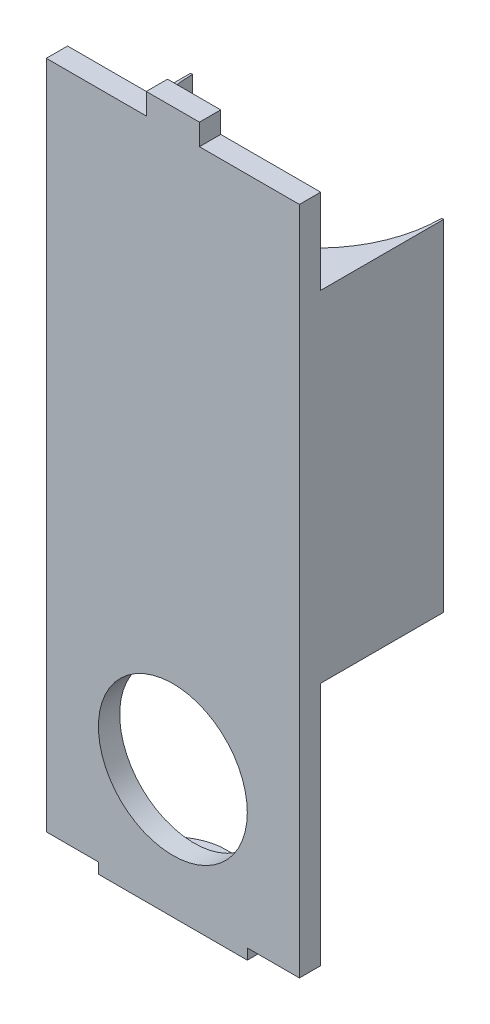
ISO-10303-21;
HEADER;
FILE_DESCRIPTION(('STEP AP214'),'2;1');
FILE_NAME('part.step','',(''),(''),'','','');
FILE_SCHEMA(('AUTOMOTIVE_DESIGN { 1 0 10303 214 1 1 1 1 }'));
ENDSEC;
DATA;
#1=APPLICATION_CONTEXT('core data for automotive mechanical design processes');
#2=APPLICATION_PROTOCOL_DEFINITION('international standard','automotive_design',2000,#1);
#3=PRODUCT_CONTEXT('',#1,'mechanical');
#4=PRODUCT('Part','Part','',(#3));
#5=PRODUCT_RELATED_PRODUCT_CATEGORY('part','',(#4));
#6=PRODUCT_DEFINITION_FORMATION('','',#4);
#7=PRODUCT_DEFINITION_CONTEXT('part definition',#1,'design');
#8=PRODUCT_DEFINITION('design','',#6,#7);
#9=PRODUCT_DEFINITION_SHAPE('','',#8);
#10=(LENGTH_UNIT() NAMED_UNIT(*) SI_UNIT(.MILLI.,.METRE.));
#11=(NAMED_UNIT(*) PLANE_ANGLE_UNIT() SI_UNIT($,.RADIAN.));
#12=(NAMED_UNIT(*) SI_UNIT($,.STERADIAN.) SOLID_ANGLE_UNIT());
#13=UNCERTAINTY_MEASURE_WITH_UNIT(LENGTH_MEASURE(1.E-05),#10,'distance_accuracy_value','');
#14=(GEOMETRIC_REPRESENTATION_CONTEXT(3) GLOBAL_UNCERTAINTY_ASSIGNED_CONTEXT((#13)) GLOBAL_UNIT_ASSIGNED_CONTEXT((#10,
#11,#12)) REPRESENTATION_CONTEXT('',''));
#15=CARTESIAN_POINT('',(0.,0.,0.));
#16=DIRECTION('',(0.,0.,1.));
#17=DIRECTION('',(1.,0.,0.));
#18=AXIS2_PLACEMENT_3D('',#15,#16,#17);
#19=CARTESIAN_POINT('',(0.,-23.,0.));
#20=DIRECTION('',(0.,1.,0.));
#21=DIRECTION('',(0.,0.,1.));
#22=AXIS2_PLACEMENT_3D('',#19,#20,#21);
#23=PLANE('',#22);
#24=DIRECTION('',(0.,0.,1.));
#25=VECTOR('',#24,1.);
#26=CARTESIAN_POINT('',(7.,-23.,0.));
#27=LINE('',#26,#25);
#28=CARTESIAN_POINT('',(7.,-23.,12.));
#29=VERTEX_POINT('',#28);
#30=CARTESIAN_POINT('',(7.,-23.,14.));
#31=VERTEX_POINT('',#30);
#32=EDGE_CURVE('E202',#29,#31,#27,.T.);
#33=ORIENTED_EDGE('',*,*,#32,.F.);
#34=DIRECTION('',(1.,0.,0.));
#35=VECTOR('',#34,1.);
#36=CARTESIAN_POINT('',(-11.9,-23.,12.));
#37=LINE('',#36,#35);
#38=CARTESIAN_POINT('',(11.9,-23.,12.));
#39=VERTEX_POINT('',#38);
#40=EDGE_CURVE('E219',#29,#39,#37,.T.);
#41=ORIENTED_EDGE('',*,*,#40,.T.);
#42=DIRECTION('',(0.,0.,-1.));
#43=VECTOR('',#42,1.);
#44=CARTESIAN_POINT('',(11.9,-23.,14.));
#45=LINE('',#44,#43);
#46=CARTESIAN_POINT('',(11.9,-23.,14.));
#47=VERTEX_POINT('',#46);
#48=EDGE_CURVE('E237',#47,#39,#45,.T.);
#49=ORIENTED_EDGE('',*,*,#48,.F.);
#50=DIRECTION('',(1.,0.,0.));
#51=VECTOR('',#50,1.);
#52=CARTESIAN_POINT('',(-11.9,-23.,14.));
#53=LINE('',#52,#51);
#54=EDGE_CURVE('E221',#31,#47,#53,.T.);
#55=ORIENTED_EDGE('',*,*,#54,.F.);
#56=EDGE_LOOP('',(#33,#41,#49,#55));
#57=FACE_BOUND('',#56,.T.);
#58=ADVANCED_FACE('F41',(#57),#23,.F.);
#59=CARTESIAN_POINT('',(0.,40.,0.));
#60=DIRECTION('',(0.,-1.,0.));
#61=DIRECTION('',(0.,0.,-1.));
#62=AXIS2_PLACEMENT_3D('',#59,#60,#61);
#63=PLANE('',#62);
#64=DIRECTION('',(0.,0.,-1.));
#65=VECTOR('',#64,1.);
#66=CARTESIAN_POINT('',(2.5,40.,0.));
#67=LINE('',#66,#65);
#68=CARTESIAN_POINT('',(2.5,40.,14.));
#69=VERTEX_POINT('',#68);
#70=CARTESIAN_POINT('',(2.5,40.,12.));
#71=VERTEX_POINT('',#70);
#72=EDGE_CURVE('E396',#69,#71,#67,.T.);
#73=ORIENTED_EDGE('',*,*,#72,.F.);
#74=DIRECTION('',(1.,0.,0.));
#75=VECTOR('',#74,1.);
#76=CARTESIAN_POINT('',(-11.9,40.,14.));
#77=LINE('',#76,#75);
#78=CARTESIAN_POINT('',(11.9,40.,14.));
#79=VERTEX_POINT('',#78);
#80=EDGE_CURVE('E371',#69,#79,#77,.T.);
#81=ORIENTED_EDGE('',*,*,#80,.T.);
#82=DIRECTION('',(0.,0.,-1.));
#83=VECTOR('',#82,1.);
#84=CARTESIAN_POINT('',(11.9,40.,14.));
#85=LINE('',#84,#83);
#86=CARTESIAN_POINT('',(11.9,40.,12.));
#87=VERTEX_POINT('',#86);
#88=EDGE_CURVE('E358',#79,#87,#85,.T.);
#89=ORIENTED_EDGE('',*,*,#88,.T.);
#90=DIRECTION('',(-1.,0.,0.));
#91=VECTOR('',#90,1.);
#92=CARTESIAN_POINT('',(-11.9,40.,12.));
#93=LINE('',#92,#91);
#94=EDGE_CURVE('E369',#87,#71,#93,.T.);
#95=ORIENTED_EDGE('',*,*,#94,.T.);
#96=EDGE_LOOP('',(#73,#81,#89,#95));
#97=FACE_BOUND('',#96,.T.);
#98=ADVANCED_FACE('F395',(#97),#63,.F.);
#99=CARTESIAN_POINT('',(0.,0.,0.));
#100=DIRECTION('',(0.,1.,0.));
#101=DIRECTION('',(0.,0.,1.));
#102=AXIS2_PLACEMENT_3D('',#99,#100,#101);
#103=PLANE('',#102);
#104=DIRECTION('',(1.,0.,0.));
#105=VECTOR('',#104,1.);
#106=CARTESIAN_POINT('',(-11.9,0.,12.));
#107=LINE('',#106,#105);
#108=CARTESIAN_POINT('',(-11.9,0.,12.));
#109=VERTEX_POINT('',#108);
#110=CARTESIAN_POINT('',(11.9,0.,12.));
#111=VERTEX_POINT('',#110);
#112=EDGE_CURVE('E233',#109,#111,#107,.T.);
#113=ORIENTED_EDGE('',*,*,#112,.F.);
#114=DIRECTION('',(0.,0.,1.));
#115=VECTOR('',#114,1.);
#116=CARTESIAN_POINT('',(-11.9,0.,0.431741638678327));
#117=LINE('',#116,#115);
#118=CARTESIAN_POINT('',(-11.9,0.,0.431741638678322));
#119=VERTEX_POINT('',#118);
#120=EDGE_CURVE('E275',#119,#109,#117,.T.);
#121=ORIENTED_EDGE('',*,*,#120,.F.);
#122=DIRECTION('',(1.,0.,0.));
#123=VECTOR('',#122,1.);
#124=CARTESIAN_POINT('',(0.,0.,0.43174163867832));
#125=LINE('',#124,#123);
#126=CARTESIAN_POINT('',(-11.7210822087198,0.,0.431741638678322));
#127=VERTEX_POINT('',#126);
#128=EDGE_CURVE('E307',#119,#127,#125,.T.);
#129=ORIENTED_EDGE('',*,*,#128,.T.);
#130=CARTESIAN_POINT('',(0.,0.,0.431741638678323));
#131=DIRECTION('',(0.,1.,0.));
#132=DIRECTION('',(0.,0.,1.));
#133=AXIS2_PLACEMENT_3D('',#130,#131,#132);
#134=CIRCLE('',#133,11.7210822087198);
#135=CARTESIAN_POINT('',(-8.48935923549125,0.,8.51348327735666));
#136=VERTEX_POINT('',#135);
#137=EDGE_CURVE('E303',#127,#136,#134,.T.);
#138=ORIENTED_EDGE('',*,*,#137,.T.);
#139=DIRECTION('',(1.,0.,0.));
#140=VECTOR('',#139,1.);
#141=CARTESIAN_POINT('',(0.,0.,8.51348327735666));
#142=LINE('',#141,#140);
#143=CARTESIAN_POINT('',(8.48935923549126,0.,8.51348327735665));
#144=VERTEX_POINT('',#143);
#145=EDGE_CURVE('E285',#136,#144,#142,.T.);
#146=ORIENTED_EDGE('',*,*,#145,.T.);
#147=CARTESIAN_POINT('',(11.7210822087198,0.,0.431741638678318));
#148=VERTEX_POINT('',#147);
#149=EDGE_CURVE('E291',#144,#148,#134,.T.);
#150=ORIENTED_EDGE('',*,*,#149,.T.);
#151=CARTESIAN_POINT('',(11.9,0.,0.431741638678318));
#152=VERTEX_POINT('',#151);
#153=EDGE_CURVE('E310',#148,#152,#125,.T.);
#154=ORIENTED_EDGE('',*,*,#153,.T.);
#155=DIRECTION('',(0.,0.,1.));
#156=VECTOR('',#155,1.);
#157=CARTESIAN_POINT('',(11.9,0.,0.431741638678327));
#158=LINE('',#157,#156);
#159=EDGE_CURVE('E269',#152,#111,#158,.T.);
#160=ORIENTED_EDGE('',*,*,#159,.T.);
#161=EDGE_LOOP('',(#113,#121,#129,#138,#146,#150,#154,#160));
#162=FACE_BOUND('',#161,.T.);
#163=ADVANCED_FACE('F507',(#162),#103,.F.);
#164=CARTESIAN_POINT('',(0.,32.,14.));
#165=DIRECTION('',(0.,0.,-1.));
#166=DIRECTION('',(-1.,0.,0.));
#167=AXIS2_PLACEMENT_3D('',#164,#165,#166);
#168=PLANE('',#167);
#169=CARTESIAN_POINT('',(0.,-11.9700847404903,14.));
#170=DIRECTION('',(0.,0.,1.));
#171=DIRECTION('',(1.,0.,0.));
#172=AXIS2_PLACEMENT_3D('',#169,#170,#171);
#173=CIRCLE('',#172,7.);
#174=CARTESIAN_POINT('',(7.,-11.9700847404903,14.));
#175=VERTEX_POINT('',#174);
#176=EDGE_CURVE('E428',#175,#175,#173,.T.);
#177=ORIENTED_EDGE('',*,*,#176,.F.);
#178=EDGE_LOOP('',(#177));
#179=FACE_BOUND('',#178,.T.);
#180=DIRECTION('',(0.,1.,0.));
#181=VECTOR('',#180,1.);
#182=CARTESIAN_POINT('',(11.9,32.,14.));
#183=LINE('',#182,#181);
#184=EDGE_CURVE('E265',#47,#79,#183,.T.);
#185=ORIENTED_EDGE('',*,*,#184,.T.);
#186=ORIENTED_EDGE('',*,*,#80,.F.);
#187=DIRECTION('',(0.,-1.,0.));
#188=VECTOR('',#187,1.);
#189=CARTESIAN_POINT('',(2.5,42.,14.));
#190=LINE('',#189,#188);
#191=CARTESIAN_POINT('',(2.5,42.,14.));
#192=VERTEX_POINT('',#191);
#193=EDGE_CURVE('E402',#192,#69,#190,.T.);
#194=ORIENTED_EDGE('',*,*,#193,.F.);
#195=DIRECTION('',(1.,0.,0.));
#196=VECTOR('',#195,1.);
#197=CARTESIAN_POINT('',(0.,42.,14.));
#198=LINE('',#197,#196);
#199=CARTESIAN_POINT('',(-2.5,42.,14.));
#200=VERTEX_POINT('',#199);
#201=EDGE_CURVE('E410',#200,#192,#198,.T.);
#202=ORIENTED_EDGE('',*,*,#201,.F.);
#203=DIRECTION('',(0.,-1.,0.));
#204=VECTOR('',#203,1.);
#205=CARTESIAN_POINT('',(-2.5,42.,14.));
#206=LINE('',#205,#204);
#207=CARTESIAN_POINT('',(-2.5,40.,14.));
#208=VERTEX_POINT('',#207);
#209=EDGE_CURVE('E424',#200,#208,#206,.T.);
#210=ORIENTED_EDGE('',*,*,#209,.T.);
#211=CARTESIAN_POINT('',(-11.9,40.,14.));
#212=VERTEX_POINT('',#211);
#213=EDGE_CURVE('E365',#212,#208,#77,.T.);
#214=ORIENTED_EDGE('',*,*,#213,.F.);
#215=DIRECTION('',(0.,1.,0.));
#216=VECTOR('',#215,1.);
#217=CARTESIAN_POINT('',(-11.9,32.,14.));
#218=LINE('',#217,#216);
#219=CARTESIAN_POINT('',(-11.9,-23.,14.));
#220=VERTEX_POINT('',#219);
#221=EDGE_CURVE('E279',#220,#212,#218,.T.);
#222=ORIENTED_EDGE('',*,*,#221,.F.);
#223=CARTESIAN_POINT('',(-7.,-23.,14.));
#224=VERTEX_POINT('',#223);
#225=EDGE_CURVE('E245',#220,#224,#53,.T.);
#226=ORIENTED_EDGE('',*,*,#225,.T.);
#227=DIRECTION('',(0.,1.,0.));
#228=VECTOR('',#227,1.);
#229=CARTESIAN_POINT('',(-7.,-24.,14.));
#230=LINE('',#229,#228);
#231=CARTESIAN_POINT('',(-7.,-24.,14.));
#232=VERTEX_POINT('',#231);
#233=EDGE_CURVE('E450',#232,#224,#230,.T.);
#234=ORIENTED_EDGE('',*,*,#233,.F.);
#235=DIRECTION('',(-1.,0.,0.));
#236=VECTOR('',#235,1.);
#237=CARTESIAN_POINT('',(0.,-24.,14.));
#238=LINE('',#237,#236);
#239=CARTESIAN_POINT('',(7.,-24.,14.));
#240=VERTEX_POINT('',#239);
#241=EDGE_CURVE('E459',#240,#232,#238,.T.);
#242=ORIENTED_EDGE('',*,*,#241,.F.);
#243=DIRECTION('',(0.,1.,0.));
#244=VECTOR('',#243,1.);
#245=CARTESIAN_POINT('',(7.,-24.,14.));
#246=LINE('',#245,#244);
#247=EDGE_CURVE('E353',#240,#31,#246,.T.);
#248=ORIENTED_EDGE('',*,*,#247,.T.);
#249=ORIENTED_EDGE('',*,*,#54,.T.);
#250=EDGE_LOOP('',(#185,#186,#194,#202,#210,#214,#222,#226,#234,#242,#248,#249));
#251=FACE_BOUND('',#250,.T.);
#252=ADVANCED_FACE('F349',(#179,#251),#168,.F.);
#253=CARTESIAN_POINT('',(0.,32.,0.));
#254=DIRECTION('',(0.,1.,0.));
#255=DIRECTION('',(0.,0.,1.));
#256=AXIS2_PLACEMENT_3D('',#253,#254,#255);
#257=PLANE('',#256);
#258=DIRECTION('',(-1.,0.,0.));
#259=VECTOR('',#258,1.);
#260=CARTESIAN_POINT('',(-11.9,32.,12.));
#261=LINE('',#260,#259);
#262=CARTESIAN_POINT('',(11.9,32.,12.));
#263=VERTEX_POINT('',#262);
#264=CARTESIAN_POINT('',(-11.9,32.,12.));
#265=VERTEX_POINT('',#264);
#266=EDGE_CURVE('E377',#263,#265,#261,.T.);
#267=ORIENTED_EDGE('',*,*,#266,.F.);
#268=DIRECTION('',(0.,0.,-1.));
#269=VECTOR('',#268,1.);
#270=CARTESIAN_POINT('',(11.9,32.,0.431741638678323));
#271=LINE('',#270,#269);
#272=CARTESIAN_POINT('',(11.9,32.,0.431741638678323));
#273=VERTEX_POINT('',#272);
#274=EDGE_CURVE('E262',#263,#273,#271,.T.);
#275=ORIENTED_EDGE('',*,*,#274,.T.);
#276=DIRECTION('',(1.,0.,0.));
#277=VECTOR('',#276,1.);
#278=CARTESIAN_POINT('',(0.,32.,0.43174163867832));
#279=LINE('',#278,#277);
#280=CARTESIAN_POINT('',(11.7210822087198,32.,0.431741638678318));
#281=VERTEX_POINT('',#280);
#282=EDGE_CURVE('E299',#281,#273,#279,.T.);
#283=ORIENTED_EDGE('',*,*,#282,.F.);
#284=CARTESIAN_POINT('',(0.,32.,0.431741638678323));
#285=DIRECTION('',(0.,1.,0.));
#286=DIRECTION('',(0.,0.,1.));
#287=AXIS2_PLACEMENT_3D('',#284,#285,#286);
#288=CIRCLE('',#287,11.7210822087198);
#289=CARTESIAN_POINT('',(8.48935923549126,32.,8.51348327735665));
#290=VERTEX_POINT('',#289);
#291=EDGE_CURVE('E296',#290,#281,#288,.T.);
#292=ORIENTED_EDGE('',*,*,#291,.F.);
#293=DIRECTION('',(1.,0.,0.));
#294=VECTOR('',#293,1.);
#295=CARTESIAN_POINT('',(0.,32.,8.51348327735666));
#296=LINE('',#295,#294);
#297=CARTESIAN_POINT('',(-8.48935923549125,32.,8.51348327735666));
#298=VERTEX_POINT('',#297);
#299=EDGE_CURVE('E286',#298,#290,#296,.T.);
#300=ORIENTED_EDGE('',*,*,#299,.F.);
#301=CARTESIAN_POINT('',(-11.7210822087198,32.,0.431741638678322));
#302=VERTEX_POINT('',#301);
#303=EDGE_CURVE('E290',#302,#298,#288,.T.);
#304=ORIENTED_EDGE('',*,*,#303,.F.);
#305=CARTESIAN_POINT('',(-11.9,32.,0.431741638678323));
#306=VERTEX_POINT('',#305);
#307=EDGE_CURVE('E295',#306,#302,#279,.T.);
#308=ORIENTED_EDGE('',*,*,#307,.F.);
#309=DIRECTION('',(0.,0.,-1.));
#310=VECTOR('',#309,1.);
#311=CARTESIAN_POINT('',(-11.9,32.,0.431741638678323));
#312=LINE('',#311,#310);
#313=EDGE_CURVE('E282',#265,#306,#312,.T.);
#314=ORIENTED_EDGE('',*,*,#313,.F.);
#315=EDGE_LOOP('',(#267,#275,#283,#292,#300,#304,#308,#314));
#316=FACE_BOUND('',#315,.T.);
#317=ADVANCED_FACE('F546',(#316),#257,.T.);
#318=CARTESIAN_POINT('',(0.,32.,0.43174163867832));
#319=DIRECTION('',(0.,0.,-1.));
#320=DIRECTION('',(-1.,0.,0.));
#321=AXIS2_PLACEMENT_3D('',#318,#319,#320);
#322=PLANE('',#321);
#323=ORIENTED_EDGE('',*,*,#282,.T.);
#324=DIRECTION('',(0.,-1.,0.));
#325=VECTOR('',#324,1.);
#326=CARTESIAN_POINT('',(11.9,32.,0.431741638678323));
#327=LINE('',#326,#325);
#328=EDGE_CURVE('E258',#273,#152,#327,.T.);
#329=ORIENTED_EDGE('',*,*,#328,.T.);
#330=ORIENTED_EDGE('',*,*,#153,.F.);
#331=DIRECTION('',(0.,-1.,0.));
#332=VECTOR('',#331,1.);
#333=CARTESIAN_POINT('',(11.7210822087198,32.,0.431741638678318));
#334=LINE('',#333,#332);
#335=EDGE_CURVE('E314',#281,#148,#334,.T.);
#336=ORIENTED_EDGE('',*,*,#335,.F.);
#337=EDGE_LOOP('',(#323,#329,#330,#336));
#338=FACE_BOUND('',#337,.T.);
#339=ADVANCED_FACE('F544',(#338),#322,.T.);
#340=ORIENTED_EDGE('',*,*,#128,.F.);
#341=DIRECTION('',(0.,-1.,0.));
#342=VECTOR('',#341,1.);
#343=CARTESIAN_POINT('',(-11.9,32.,0.431741638678323));
#344=LINE('',#343,#342);
#345=EDGE_CURVE('E272',#306,#119,#344,.T.);
#346=ORIENTED_EDGE('',*,*,#345,.F.);
#347=ORIENTED_EDGE('',*,*,#307,.T.);
#348=DIRECTION('',(0.,-1.,0.));
#349=VECTOR('',#348,1.);
#350=CARTESIAN_POINT('',(-11.7210822087198,32.,0.431741638678322));
#351=LINE('',#350,#349);
#352=EDGE_CURVE('E317',#302,#127,#351,.T.);
#353=ORIENTED_EDGE('',*,*,#352,.T.);
#354=EDGE_LOOP('',(#340,#346,#347,#353));
#355=FACE_BOUND('',#354,.T.);
#356=ADVANCED_FACE('F528',(#355),#322,.T.);
#357=CARTESIAN_POINT('',(0.,32.,8.51348327735666));
#358=DIRECTION('',(0.,0.,-1.));
#359=DIRECTION('',(-1.,0.,0.));
#360=AXIS2_PLACEMENT_3D('',#357,#358,#359);
#361=PLANE('',#360);
#362=ORIENTED_EDGE('',*,*,#145,.F.);
#363=DIRECTION('',(0.,-1.,0.));
#364=VECTOR('',#363,1.);
#365=CARTESIAN_POINT('',(-8.48935923549125,32.,8.51348327735666));
#366=LINE('',#365,#364);
#367=EDGE_CURVE('E321',#298,#136,#366,.T.);
#368=ORIENTED_EDGE('',*,*,#367,.F.);
#369=ORIENTED_EDGE('',*,*,#299,.T.);
#370=DIRECTION('',(0.,-1.,0.));
#371=VECTOR('',#370,1.);
#372=CARTESIAN_POINT('',(8.48935923549126,32.,8.51348327735665));
#373=LINE('',#372,#371);
#374=EDGE_CURVE('E311',#290,#144,#373,.T.);
#375=ORIENTED_EDGE('',*,*,#374,.T.);
#376=EDGE_LOOP('',(#362,#368,#369,#375));
#377=FACE_BOUND('',#376,.T.);
#378=ADVANCED_FACE('F548',(#377),#361,.T.);
#379=CARTESIAN_POINT('',(0.,32.,0.431741638678323));
#380=DIRECTION('',(0.,-1.,0.));
#381=DIRECTION('',(0.,0.,-1.));
#382=AXIS2_PLACEMENT_3D('',#379,#380,#381);
#383=CYLINDRICAL_SURFACE('',#382,11.7210822087198);
#384=ORIENTED_EDGE('',*,*,#137,.F.);
#385=ORIENTED_EDGE('',*,*,#352,.F.);
#386=ORIENTED_EDGE('',*,*,#303,.T.);
#387=ORIENTED_EDGE('',*,*,#367,.T.);
#388=EDGE_LOOP('',(#384,#385,#386,#387));
#389=FACE_BOUND('',#388,.T.);
#390=ADVANCED_FACE('F534',(#389),#383,.F.);
#391=ORIENTED_EDGE('',*,*,#149,.F.);
#392=ORIENTED_EDGE('',*,*,#374,.F.);
#393=ORIENTED_EDGE('',*,*,#291,.T.);
#394=ORIENTED_EDGE('',*,*,#335,.T.);
#395=EDGE_LOOP('',(#391,#392,#393,#394));
#396=FACE_BOUND('',#395,.T.);
#397=ADVANCED_FACE('F539',(#396),#383,.F.);
#398=CARTESIAN_POINT('',(-11.9,0.,0.));
#399=DIRECTION('',(-1.,0.,0.));
#400=DIRECTION('',(0.,0.,1.));
#401=AXIS2_PLACEMENT_3D('',#398,#399,#400);
#402=PLANE('',#401);
#403=ORIENTED_EDGE('',*,*,#345,.T.);
#404=ORIENTED_EDGE('',*,*,#120,.T.);
#405=DIRECTION('',(0.,1.,0.));
#406=VECTOR('',#405,1.);
#407=CARTESIAN_POINT('',(-11.9,-23.,12.));
#408=LINE('',#407,#406);
#409=CARTESIAN_POINT('',(-11.9,-23.,12.));
#410=VERTEX_POINT('',#409);
#411=EDGE_CURVE('E251',#410,#109,#408,.T.);
#412=ORIENTED_EDGE('',*,*,#411,.F.);
#413=DIRECTION('',(0.,0.,-1.));
#414=VECTOR('',#413,1.);
#415=CARTESIAN_POINT('',(-11.9,-23.,14.));
#416=LINE('',#415,#414);
#417=EDGE_CURVE('E249',#220,#410,#416,.T.);
#418=ORIENTED_EDGE('',*,*,#417,.F.);
#419=ORIENTED_EDGE('',*,*,#221,.T.);
#420=DIRECTION('',(0.,0.,1.));
#421=VECTOR('',#420,1.);
#422=CARTESIAN_POINT('',(-11.9,40.,14.));
#423=LINE('',#422,#421);
#424=CARTESIAN_POINT('',(-11.9,40.,12.));
#425=VERTEX_POINT('',#424);
#426=EDGE_CURVE('E380',#425,#212,#423,.T.);
#427=ORIENTED_EDGE('',*,*,#426,.F.);
#428=DIRECTION('',(0.,-1.,0.));
#429=VECTOR('',#428,1.);
#430=CARTESIAN_POINT('',(-11.9,40.,12.));
#431=LINE('',#430,#429);
#432=EDGE_CURVE('E376',#425,#265,#431,.T.);
#433=ORIENTED_EDGE('',*,*,#432,.T.);
#434=ORIENTED_EDGE('',*,*,#313,.T.);
#435=EDGE_LOOP('',(#403,#404,#412,#418,#419,#427,#433,#434));
#436=FACE_BOUND('',#435,.T.);
#437=ADVANCED_FACE('F522',(#436),#402,.T.);
#438=CARTESIAN_POINT('',(11.9,0.,0.));
#439=DIRECTION('',(1.,0.,0.));
#440=DIRECTION('',(0.,0.,1.));
#441=AXIS2_PLACEMENT_3D('',#438,#439,#440);
#442=PLANE('',#441);
#443=ORIENTED_EDGE('',*,*,#328,.F.);
#444=ORIENTED_EDGE('',*,*,#274,.F.);
#445=DIRECTION('',(0.,-1.,0.));
#446=VECTOR('',#445,1.);
#447=CARTESIAN_POINT('',(11.9,40.,12.));
#448=LINE('',#447,#446);
#449=EDGE_CURVE('E238',#87,#263,#448,.T.);
#450=ORIENTED_EDGE('',*,*,#449,.F.);
#451=ORIENTED_EDGE('',*,*,#88,.F.);
#452=ORIENTED_EDGE('',*,*,#184,.F.);
#453=ORIENTED_EDGE('',*,*,#48,.T.);
#454=DIRECTION('',(0.,1.,0.));
#455=VECTOR('',#454,1.);
#456=CARTESIAN_POINT('',(11.9,-23.,12.));
#457=LINE('',#456,#455);
#458=EDGE_CURVE('E229',#39,#111,#457,.T.);
#459=ORIENTED_EDGE('',*,*,#458,.T.);
#460=ORIENTED_EDGE('',*,*,#159,.F.);
#461=EDGE_LOOP('',(#443,#444,#450,#451,#452,#453,#459,#460));
#462=FACE_BOUND('',#461,.T.);
#463=ADVANCED_FACE('F356',(#462),#442,.T.);
#464=CARTESIAN_POINT('',(-11.9,-23.,12.));
#465=DIRECTION('',(0.,0.,1.));
#466=DIRECTION('',(1.,0.,0.));
#467=AXIS2_PLACEMENT_3D('',#464,#465,#466);
#468=PLANE('',#467);
#469=CARTESIAN_POINT('',(0.,-11.9700847404903,12.));
#470=DIRECTION('',(0.,0.,1.));
#471=DIRECTION('',(1.,0.,0.));
#472=AXIS2_PLACEMENT_3D('',#469,#470,#471);
#473=CIRCLE('',#472,7.);
#474=CARTESIAN_POINT('',(7.,-11.9700847404903,12.));
#475=VERTEX_POINT('',#474);
#476=EDGE_CURVE('E381',#475,#475,#473,.F.);
#477=ORIENTED_EDGE('',*,*,#476,.F.);
#478=EDGE_LOOP('',(#477));
#479=FACE_BOUND('',#478,.T.);
#480=ORIENTED_EDGE('',*,*,#40,.F.);
#481=DIRECTION('',(-1.,0.,0.));
#482=VECTOR('',#481,1.);
#483=CARTESIAN_POINT('',(-7.,-23.,12.));
#484=LINE('',#483,#482);
#485=CARTESIAN_POINT('',(-7.,-23.,12.));
#486=VERTEX_POINT('',#485);
#487=EDGE_CURVE('E206',#29,#486,#484,.T.);
#488=ORIENTED_EDGE('',*,*,#487,.T.);
#489=EDGE_CURVE('E232',#410,#486,#37,.T.);
#490=ORIENTED_EDGE('',*,*,#489,.F.);
#491=ORIENTED_EDGE('',*,*,#411,.T.);
#492=ORIENTED_EDGE('',*,*,#112,.T.);
#493=ORIENTED_EDGE('',*,*,#458,.F.);
#494=EDGE_LOOP('',(#480,#488,#490,#491,#492,#493));
#495=FACE_BOUND('',#494,.T.);
#496=ADVANCED_FACE('F226',(#479,#495),#468,.F.);
#497=ORIENTED_EDGE('',*,*,#489,.T.);
#498=DIRECTION('',(0.,0.,1.));
#499=VECTOR('',#498,1.);
#500=CARTESIAN_POINT('',(-7.,-23.,0.));
#501=LINE('',#500,#499);
#502=EDGE_CURVE('E223',#486,#224,#501,.T.);
#503=ORIENTED_EDGE('',*,*,#502,.T.);
#504=ORIENTED_EDGE('',*,*,#225,.F.);
#505=ORIENTED_EDGE('',*,*,#417,.T.);
#506=EDGE_LOOP('',(#497,#503,#504,#505));
#507=FACE_BOUND('',#506,.T.);
#508=ADVANCED_FACE('F503',(#507),#23,.F.);
#509=CARTESIAN_POINT('',(-11.9,40.,12.));
#510=DIRECTION('',(0.,0.,1.));
#511=DIRECTION('',(1.,0.,0.));
#512=AXIS2_PLACEMENT_3D('',#509,#510,#511);
#513=PLANE('',#512);
#514=ORIENTED_EDGE('',*,*,#266,.T.);
#515=ORIENTED_EDGE('',*,*,#432,.F.);
#516=CARTESIAN_POINT('',(-2.5,40.,12.));
#517=VERTEX_POINT('',#516);
#518=EDGE_CURVE('E364',#517,#425,#93,.T.);
#519=ORIENTED_EDGE('',*,*,#518,.F.);
#520=DIRECTION('',(0.,-1.,0.));
#521=VECTOR('',#520,1.);
#522=CARTESIAN_POINT('',(-2.5,42.,12.));
#523=LINE('',#522,#521);
#524=CARTESIAN_POINT('',(-2.5,42.,12.));
#525=VERTEX_POINT('',#524);
#526=EDGE_CURVE('E415',#525,#517,#523,.T.);
#527=ORIENTED_EDGE('',*,*,#526,.F.);
#528=DIRECTION('',(-1.,0.,0.));
#529=VECTOR('',#528,1.);
#530=CARTESIAN_POINT('',(0.,42.,12.));
#531=LINE('',#530,#529);
#532=CARTESIAN_POINT('',(2.5,42.,12.));
#533=VERTEX_POINT('',#532);
#534=EDGE_CURVE('E419',#533,#525,#531,.T.);
#535=ORIENTED_EDGE('',*,*,#534,.F.);
#536=DIRECTION('',(0.,-1.,0.));
#537=VECTOR('',#536,1.);
#538=CARTESIAN_POINT('',(2.5,42.,12.));
#539=LINE('',#538,#537);
#540=EDGE_CURVE('E393',#533,#71,#539,.T.);
#541=ORIENTED_EDGE('',*,*,#540,.T.);
#542=ORIENTED_EDGE('',*,*,#94,.F.);
#543=ORIENTED_EDGE('',*,*,#449,.T.);
#544=EDGE_LOOP('',(#514,#515,#519,#527,#535,#541,#542,#543));
#545=FACE_BOUND('',#544,.T.);
#546=ADVANCED_FACE('F389',(#545),#513,.F.);
#547=ORIENTED_EDGE('',*,*,#213,.T.);
#548=DIRECTION('',(0.,0.,-1.));
#549=VECTOR('',#548,1.);
#550=CARTESIAN_POINT('',(-2.5,40.,0.));
#551=LINE('',#550,#549);
#552=EDGE_CURVE('E405',#208,#517,#551,.T.);
#553=ORIENTED_EDGE('',*,*,#552,.T.);
#554=ORIENTED_EDGE('',*,*,#518,.T.);
#555=ORIENTED_EDGE('',*,*,#426,.T.);
#556=EDGE_LOOP('',(#547,#553,#554,#555));
#557=FACE_BOUND('',#556,.T.);
#558=ADVANCED_FACE('F509',(#557),#63,.F.);
#559=CARTESIAN_POINT('',(0.,-11.9700847404903,0.430741638678319));
#560=DIRECTION('',(0.,0.,1.));
#561=DIRECTION('',(1.,0.,0.));
#562=AXIS2_PLACEMENT_3D('',#559,#560,#561);
#563=CYLINDRICAL_SURFACE('',#562,7.);
#564=ORIENTED_EDGE('',*,*,#176,.T.);
#565=EDGE_LOOP('',(#564));
#566=FACE_BOUND('',#565,.T.);
#567=ORIENTED_EDGE('',*,*,#476,.T.);
#568=EDGE_LOOP('',(#567));
#569=FACE_BOUND('',#568,.T.);
#570=ADVANCED_FACE('F680',(#566,#569),#563,.F.);
#571=CARTESIAN_POINT('',(-2.5,42.,0.));
#572=DIRECTION('',(-1.,0.,0.));
#573=DIRECTION('',(0.,0.,1.));
#574=AXIS2_PLACEMENT_3D('',#571,#572,#573);
#575=PLANE('',#574);
#576=ORIENTED_EDGE('',*,*,#552,.F.);
#577=ORIENTED_EDGE('',*,*,#209,.F.);
#578=DIRECTION('',(0.,0.,-1.));
#579=VECTOR('',#578,1.);
#580=CARTESIAN_POINT('',(-2.5,42.,0.));
#581=LINE('',#580,#579);
#582=EDGE_CURVE('E404',#200,#525,#581,.T.);
#583=ORIENTED_EDGE('',*,*,#582,.T.);
#584=ORIENTED_EDGE('',*,*,#526,.T.);
#585=EDGE_LOOP('',(#576,#577,#583,#584));
#586=FACE_BOUND('',#585,.T.);
#587=ADVANCED_FACE('F671',(#586),#575,.T.);
#588=CARTESIAN_POINT('',(2.5,42.,0.));
#589=DIRECTION('',(-1.,0.,0.));
#590=DIRECTION('',(0.,0.,1.));
#591=AXIS2_PLACEMENT_3D('',#588,#589,#590);
#592=PLANE('',#591);
#593=ORIENTED_EDGE('',*,*,#72,.T.);
#594=ORIENTED_EDGE('',*,*,#540,.F.);
#595=DIRECTION('',(0.,0.,-1.));
#596=VECTOR('',#595,1.);
#597=CARTESIAN_POINT('',(2.5,42.,0.));
#598=LINE('',#597,#596);
#599=EDGE_CURVE('E440',#192,#533,#598,.T.);
#600=ORIENTED_EDGE('',*,*,#599,.F.);
#601=ORIENTED_EDGE('',*,*,#193,.T.);
#602=EDGE_LOOP('',(#593,#594,#600,#601));
#603=FACE_BOUND('',#602,.T.);
#604=ADVANCED_FACE('F399',(#603),#592,.F.);
#605=CARTESIAN_POINT('',(0.,42.,0.));
#606=DIRECTION('',(0.,1.,0.));
#607=DIRECTION('',(0.,0.,1.));
#608=AXIS2_PLACEMENT_3D('',#605,#606,#607);
#609=PLANE('',#608);
#610=ORIENTED_EDGE('',*,*,#582,.F.);
#611=ORIENTED_EDGE('',*,*,#201,.T.);
#612=ORIENTED_EDGE('',*,*,#599,.T.);
#613=ORIENTED_EDGE('',*,*,#534,.T.);
#614=EDGE_LOOP('',(#610,#611,#612,#613));
#615=FACE_BOUND('',#614,.T.);
#616=ADVANCED_FACE('F598',(#615),#609,.T.);
#617=CARTESIAN_POINT('',(7.,-24.,0.));
#618=DIRECTION('',(-1.,0.,0.));
#619=DIRECTION('',(0.,0.,1.));
#620=AXIS2_PLACEMENT_3D('',#617,#618,#619);
#621=PLANE('',#620);
#622=DIRECTION('',(0.,0.,1.));
#623=VECTOR('',#622,1.);
#624=CARTESIAN_POINT('',(7.,-24.,0.));
#625=LINE('',#624,#623);
#626=CARTESIAN_POINT('',(7.,-24.,12.));
#627=VERTEX_POINT('',#626);
#628=EDGE_CURVE('E204',#627,#240,#625,.T.);
#629=ORIENTED_EDGE('',*,*,#628,.F.);
#630=DIRECTION('',(0.,1.,0.));
#631=VECTOR('',#630,1.);
#632=CARTESIAN_POINT('',(7.,-23.,12.));
#633=LINE('',#632,#631);
#634=EDGE_CURVE('E11',#627,#29,#633,.T.);
#635=ORIENTED_EDGE('',*,*,#634,.T.);
#636=ORIENTED_EDGE('',*,*,#32,.T.);
#637=ORIENTED_EDGE('',*,*,#247,.F.);
#638=EDGE_LOOP('',(#629,#635,#636,#637));
#639=FACE_BOUND('',#638,.T.);
#640=ADVANCED_FACE('F199',(#639),#621,.F.);
#641=CARTESIAN_POINT('',(-7.,-24.,0.));
#642=DIRECTION('',(-1.,0.,0.));
#643=DIRECTION('',(0.,0.,1.));
#644=AXIS2_PLACEMENT_3D('',#641,#642,#643);
#645=PLANE('',#644);
#646=ORIENTED_EDGE('',*,*,#502,.F.);
#647=DIRECTION('',(0.,-1.,0.));
#648=VECTOR('',#647,1.);
#649=CARTESIAN_POINT('',(-7.,-24.,12.));
#650=LINE('',#649,#648);
#651=CARTESIAN_POINT('',(-7.,-24.,12.));
#652=VERTEX_POINT('',#651);
#653=EDGE_CURVE('E324',#486,#652,#650,.T.);
#654=ORIENTED_EDGE('',*,*,#653,.T.);
#655=DIRECTION('',(0.,0.,1.));
#656=VECTOR('',#655,1.);
#657=CARTESIAN_POINT('',(-7.,-24.,0.));
#658=LINE('',#657,#656);
#659=EDGE_CURVE('E454',#652,#232,#658,.T.);
#660=ORIENTED_EDGE('',*,*,#659,.T.);
#661=ORIENTED_EDGE('',*,*,#233,.T.);
#662=EDGE_LOOP('',(#646,#654,#660,#661));
#663=FACE_BOUND('',#662,.T.);
#664=ADVANCED_FACE('F483',(#663),#645,.T.);
#665=CARTESIAN_POINT('',(0.,-24.,0.));
#666=DIRECTION('',(0.,-1.,0.));
#667=DIRECTION('',(0.,0.,-1.));
#668=AXIS2_PLACEMENT_3D('',#665,#666,#667);
#669=PLANE('',#668);
#670=CARTESIAN_POINT('',(0.,-24.,9.49999999999999));
#671=DIRECTION('',(0.,-1.,0.));
#672=DIRECTION('',(0.,0.,-1.));
#673=AXIS2_PLACEMENT_3D('',#670,#671,#672);
#674=CIRCLE('',#673,1.5);
#675=CARTESIAN_POINT('',(0.,-24.,7.99999999999999));
#676=VERTEX_POINT('',#675);
#677=EDGE_CURVE('E215',#676,#676,#674,.T.);
#678=ORIENTED_EDGE('',*,*,#677,.F.);
#679=EDGE_LOOP('',(#678));
#680=FACE_BOUND('',#679,.T.);
#681=ORIENTED_EDGE('',*,*,#659,.F.);
#682=CARTESIAN_POINT('',(-2.,-24.,12.));
#683=DIRECTION('',(0.,-1.,0.));
#684=DIRECTION('',(0.,0.,-1.));
#685=AXIS2_PLACEMENT_3D('',#682,#683,#684);
#686=CIRCLE('',#685,5.);
#687=CARTESIAN_POINT('',(-2.,-24.,7.));
#688=VERTEX_POINT('',#687);
#689=EDGE_CURVE('E331',#652,#688,#686,.T.);
#690=ORIENTED_EDGE('',*,*,#689,.T.);
#691=DIRECTION('',(1.,0.,0.));
#692=VECTOR('',#691,1.);
#693=CARTESIAN_POINT('',(-7.,-24.,7.));
#694=LINE('',#693,#692);
#695=CARTESIAN_POINT('',(2.,-24.,7.));
#696=VERTEX_POINT('',#695);
#697=EDGE_CURVE('E214',#688,#696,#694,.T.);
#698=ORIENTED_EDGE('',*,*,#697,.T.);
#699=CARTESIAN_POINT('',(2.,-24.,12.));
#700=DIRECTION('',(0.,-1.,0.));
#701=DIRECTION('',(0.,0.,-1.));
#702=AXIS2_PLACEMENT_3D('',#699,#700,#701);
#703=CIRCLE('',#702,5.);
#704=EDGE_CURVE('E328',#696,#627,#703,.T.);
#705=ORIENTED_EDGE('',*,*,#704,.T.);
#706=ORIENTED_EDGE('',*,*,#628,.T.);
#707=ORIENTED_EDGE('',*,*,#241,.T.);
#708=EDGE_LOOP('',(#681,#690,#698,#705,#706,#707));
#709=FACE_BOUND('',#708,.T.);
#710=ADVANCED_FACE('F480',(#680,#709),#669,.T.);
#711=CARTESIAN_POINT('',(-7.,-23.,7.));
#712=DIRECTION('',(0.,1.,0.));
#713=DIRECTION('',(0.,0.,1.));
#714=AXIS2_PLACEMENT_3D('',#711,#712,#713);
#715=PLANE('',#714);
#716=CARTESIAN_POINT('',(0.,-23.,9.49999999999999));
#717=DIRECTION('',(0.,1.,0.));
#718=DIRECTION('',(0.,0.,1.));
#719=AXIS2_PLACEMENT_3D('',#716,#717,#718);
#720=CIRCLE('',#719,1.5);
#721=CARTESIAN_POINT('',(0.,-23.,11.));
#722=VERTEX_POINT('',#721);
#723=EDGE_CURVE('E470',#722,#722,#720,.F.);
#724=ORIENTED_EDGE('',*,*,#723,.T.);
#725=EDGE_LOOP('',(#724));
#726=FACE_BOUND('',#725,.T.);
#727=DIRECTION('',(-1.,0.,0.));
#728=VECTOR('',#727,1.);
#729=CARTESIAN_POINT('',(-7.,-23.,7.));
#730=LINE('',#729,#728);
#731=CARTESIAN_POINT('',(2.,-23.,7.));
#732=VERTEX_POINT('',#731);
#733=CARTESIAN_POINT('',(-2.,-23.,7.));
#734=VERTEX_POINT('',#733);
#735=EDGE_CURVE('E224',#732,#734,#730,.T.);
#736=ORIENTED_EDGE('',*,*,#735,.T.);
#737=CARTESIAN_POINT('',(-2.,-23.,12.));
#738=DIRECTION('',(0.,1.,0.));
#739=DIRECTION('',(0.,0.,1.));
#740=AXIS2_PLACEMENT_3D('',#737,#738,#739);
#741=CIRCLE('',#740,5.);
#742=EDGE_CURVE('E50',#734,#486,#741,.T.);
#743=ORIENTED_EDGE('',*,*,#742,.T.);
#744=ORIENTED_EDGE('',*,*,#487,.F.);
#745=CARTESIAN_POINT('',(2.,-23.,12.));
#746=DIRECTION('',(0.,1.,0.));
#747=DIRECTION('',(0.,0.,1.));
#748=AXIS2_PLACEMENT_3D('',#745,#746,#747);
#749=CIRCLE('',#748,5.);
#750=EDGE_CURVE('E64',#29,#732,#749,.T.);
#751=ORIENTED_EDGE('',*,*,#750,.T.);
#752=EDGE_LOOP('',(#736,#743,#744,#751));
#753=FACE_BOUND('',#752,.T.);
#754=ADVANCED_FACE('F207',(#726,#753),#715,.T.);
#755=CARTESIAN_POINT('',(0.,0.,7.));
#756=DIRECTION('',(0.,0.,-1.));
#757=DIRECTION('',(-1.,0.,0.));
#758=AXIS2_PLACEMENT_3D('',#755,#756,#757);
#759=PLANE('',#758);
#760=ORIENTED_EDGE('',*,*,#697,.F.);
#761=DIRECTION('',(0.,-1.,0.));
#762=VECTOR('',#761,1.);
#763=CARTESIAN_POINT('',(-2.,0.,7.));
#764=LINE('',#763,#762);
#765=EDGE_CURVE('E57',#688,#734,#764,.F.);
#766=ORIENTED_EDGE('',*,*,#765,.T.);
#767=ORIENTED_EDGE('',*,*,#735,.F.);
#768=DIRECTION('',(0.,1.,0.));
#769=VECTOR('',#768,1.);
#770=CARTESIAN_POINT('',(2.,-24.,7.));
#771=LINE('',#770,#769);
#772=EDGE_CURVE('E193',#732,#696,#771,.F.);
#773=ORIENTED_EDGE('',*,*,#772,.T.);
#774=EDGE_LOOP('',(#760,#766,#767,#773));
#775=FACE_BOUND('',#774,.T.);
#776=ADVANCED_FACE('F497',(#775),#759,.T.);
#777=CARTESIAN_POINT('',(0.,42.001,9.49999999999999));
#778=DIRECTION('',(0.,-1.,0.));
#779=DIRECTION('',(0.,0.,-1.));
#780=AXIS2_PLACEMENT_3D('',#777,#778,#779);
#781=CYLINDRICAL_SURFACE('',#780,1.5);
#782=ORIENTED_EDGE('',*,*,#723,.F.);
#783=EDGE_LOOP('',(#782));
#784=FACE_BOUND('',#783,.T.);
#785=ORIENTED_EDGE('',*,*,#677,.T.);
#786=EDGE_LOOP('',(#785));
#787=FACE_BOUND('',#786,.T.);
#788=ADVANCED_FACE('F478',(#784,#787),#781,.F.);
#789=CARTESIAN_POINT('',(-2.,-24.,12.));
#790=DIRECTION('',(0.,-1.,0.));
#791=DIRECTION('',(0.,0.,-1.));
#792=AXIS2_PLACEMENT_3D('',#789,#790,#791);
#793=CYLINDRICAL_SURFACE('',#792,5.);
#794=ORIENTED_EDGE('',*,*,#742,.F.);
#795=ORIENTED_EDGE('',*,*,#765,.F.);
#796=ORIENTED_EDGE('',*,*,#689,.F.);
#797=ORIENTED_EDGE('',*,*,#653,.F.);
#798=EDGE_LOOP('',(#794,#795,#796,#797));
#799=FACE_BOUND('',#798,.T.);
#800=ADVANCED_FACE('F491',(#799),#793,.T.);
#801=CARTESIAN_POINT('',(2.,-24.,12.));
#802=DIRECTION('',(0.,-1.,0.));
#803=DIRECTION('',(0.,0.,-1.));
#804=AXIS2_PLACEMENT_3D('',#801,#802,#803);
#805=CYLINDRICAL_SURFACE('',#804,5.);
#806=ORIENTED_EDGE('',*,*,#704,.F.);
#807=ORIENTED_EDGE('',*,*,#772,.F.);
#808=ORIENTED_EDGE('',*,*,#750,.F.);
#809=ORIENTED_EDGE('',*,*,#634,.F.);
#810=EDGE_LOOP('',(#806,#807,#808,#809));
#811=FACE_BOUND('',#810,.T.);
#812=ADVANCED_FACE('F43',(#811),#805,.T.);
#813=CLOSED_SHELL('',(#58,#98,#163,#252,#317,#339,#356,#378,#390,#397,#437,#463,#496,#508,#546,
#558,#570,#587,#604,#616,#640,#664,#710,#754,#776,#788,#800,#812));
#814=MANIFOLD_SOLID_BREP('B2',#813);
#815=ADVANCED_BREP_SHAPE_REPRESENTATION('',(#18,#814),#14);
#816=SHAPE_DEFINITION_REPRESENTATION(#9,#815);
ENDSEC;
END-ISO-10303-21;
